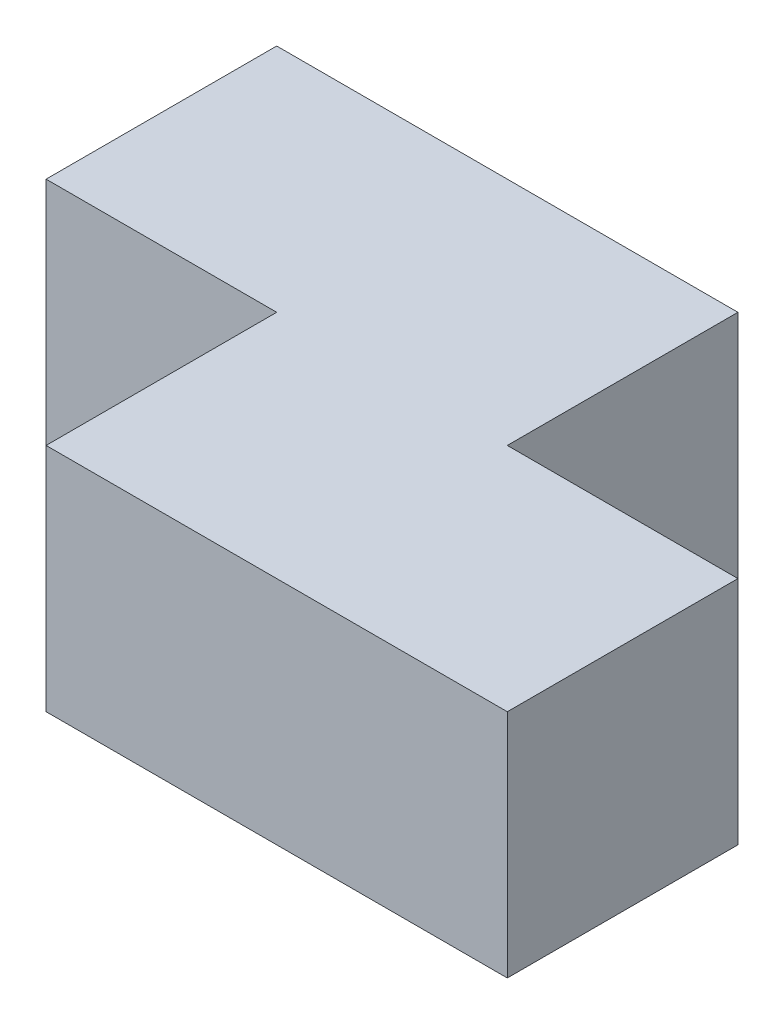
ISO-10303-21;
HEADER;
FILE_DESCRIPTION(('STEP AP214'),'2;1');
FILE_NAME('part.step','',(''),(''),'','','');
FILE_SCHEMA(('AUTOMOTIVE_DESIGN { 1 0 10303 214 1 1 1 1 }'));
ENDSEC;
DATA;
#1=APPLICATION_CONTEXT('core data for automotive mechanical design processes');
#2=APPLICATION_PROTOCOL_DEFINITION('international standard','automotive_design',2000,#1);
#3=PRODUCT_CONTEXT('',#1,'mechanical');
#4=PRODUCT('Part','Part','',(#3));
#5=PRODUCT_RELATED_PRODUCT_CATEGORY('part','',(#4));
#6=PRODUCT_DEFINITION_FORMATION('','',#4);
#7=PRODUCT_DEFINITION_CONTEXT('part definition',#1,'design');
#8=PRODUCT_DEFINITION('design','',#6,#7);
#9=PRODUCT_DEFINITION_SHAPE('','',#8);
#10=(LENGTH_UNIT() NAMED_UNIT(*) SI_UNIT(.MILLI.,.METRE.));
#11=(NAMED_UNIT(*) PLANE_ANGLE_UNIT() SI_UNIT($,.RADIAN.));
#12=(NAMED_UNIT(*) SI_UNIT($,.STERADIAN.) SOLID_ANGLE_UNIT());
#13=UNCERTAINTY_MEASURE_WITH_UNIT(LENGTH_MEASURE(1.E-05),#10,'distance_accuracy_value','');
#14=(GEOMETRIC_REPRESENTATION_CONTEXT(3) GLOBAL_UNCERTAINTY_ASSIGNED_CONTEXT((#13)) GLOBAL_UNIT_ASSIGNED_CONTEXT((#10,
#11,#12)) REPRESENTATION_CONTEXT('',''));
#15=CARTESIAN_POINT('',(0.,0.,0.));
#16=DIRECTION('',(0.,0.,1.));
#17=DIRECTION('',(1.,0.,0.));
#18=AXIS2_PLACEMENT_3D('',#15,#16,#17);
#19=CARTESIAN_POINT('',(38.1,25.4,25.4));
#20=DIRECTION('',(-1.,0.,0.));
#21=DIRECTION('',(0.,0.,1.));
#22=AXIS2_PLACEMENT_3D('',#19,#20,#21);
#23=PLANE('',#22);
#24=DIRECTION('',(0.,0.,-1.));
#25=VECTOR('',#24,1.);
#26=CARTESIAN_POINT('',(38.1,0.,25.4));
#27=LINE('',#26,#25);
#28=CARTESIAN_POINT('',(38.1,0.,25.4));
#29=VERTEX_POINT('',#28);
#30=CARTESIAN_POINT('',(38.1,0.,0.));
#31=VERTEX_POINT('',#30);
#32=EDGE_CURVE('E118',#29,#31,#27,.T.);
#33=ORIENTED_EDGE('',*,*,#32,.T.);
#34=DIRECTION('',(0.,1.,0.));
#35=VECTOR('',#34,1.);
#36=CARTESIAN_POINT('',(38.1,0.,0.));
#37=LINE('',#36,#35);
#38=CARTESIAN_POINT('',(38.1,25.4,0.));
#39=VERTEX_POINT('',#38);
#40=EDGE_CURVE('E156',#31,#39,#37,.T.);
#41=ORIENTED_EDGE('',*,*,#40,.T.);
#42=DIRECTION('',(0.,0.,-1.));
#43=VECTOR('',#42,1.);
#44=CARTESIAN_POINT('',(38.1,25.4,25.4));
#45=LINE('',#44,#43);
#46=CARTESIAN_POINT('',(38.1,25.4,25.4));
#47=VERTEX_POINT('',#46);
#48=EDGE_CURVE('E127',#47,#39,#45,.T.);
#49=ORIENTED_EDGE('',*,*,#48,.F.);
#50=DIRECTION('',(0.,-1.,0.));
#51=VECTOR('',#50,1.);
#52=CARTESIAN_POINT('',(38.1,25.4,25.4));
#53=LINE('',#52,#51);
#54=EDGE_CURVE('E40',#47,#29,#53,.T.);
#55=ORIENTED_EDGE('',*,*,#54,.T.);
#56=EDGE_LOOP('',(#33,#41,#49,#55));
#57=FACE_BOUND('',#56,.T.);
#58=ADVANCED_FACE('F33',(#57),#23,.F.);
#59=CARTESIAN_POINT('',(-38.1,25.4,-25.4));
#60=DIRECTION('',(0.,0.,1.));
#61=DIRECTION('',(1.,0.,0.));
#62=AXIS2_PLACEMENT_3D('',#59,#60,#61);
#63=PLANE('',#62);
#64=DIRECTION('',(-1.,0.,0.));
#65=VECTOR('',#64,1.);
#66=CARTESIAN_POINT('',(-38.1,25.4,-25.4));
#67=LINE('',#66,#65);
#68=CARTESIAN_POINT('',(12.7,25.4,-25.4));
#69=VERTEX_POINT('',#68);
#70=CARTESIAN_POINT('',(-38.1,25.4,-25.4));
#71=VERTEX_POINT('',#70);
#72=EDGE_CURVE('E112',#69,#71,#67,.T.);
#73=ORIENTED_EDGE('',*,*,#72,.F.);
#74=DIRECTION('',(0.,1.,0.));
#75=VECTOR('',#74,1.);
#76=CARTESIAN_POINT('',(12.7,0.,-25.4));
#77=LINE('',#76,#75);
#78=CARTESIAN_POINT('',(12.7,0.,-25.4));
#79=VERTEX_POINT('',#78);
#80=EDGE_CURVE('E100',#79,#69,#77,.T.);
#81=ORIENTED_EDGE('',*,*,#80,.F.);
#82=DIRECTION('',(-1.,0.,0.));
#83=VECTOR('',#82,1.);
#84=CARTESIAN_POINT('',(-38.1,0.,-25.4));
#85=LINE('',#84,#83);
#86=CARTESIAN_POINT('',(-38.1,0.,-25.4));
#87=VERTEX_POINT('',#86);
#88=EDGE_CURVE('E111',#79,#87,#85,.T.);
#89=ORIENTED_EDGE('',*,*,#88,.T.);
#90=DIRECTION('',(0.,-1.,0.));
#91=VECTOR('',#90,1.);
#92=CARTESIAN_POINT('',(-38.1,25.4,-25.4));
#93=LINE('',#92,#91);
#94=EDGE_CURVE('E11',#71,#87,#93,.T.);
#95=ORIENTED_EDGE('',*,*,#94,.F.);
#96=EDGE_LOOP('',(#73,#81,#89,#95));
#97=FACE_BOUND('',#96,.T.);
#98=ADVANCED_FACE('F109',(#97),#63,.F.);
#99=CARTESIAN_POINT('',(-38.1,25.4,25.4));
#100=DIRECTION('',(1.,0.,0.));
#101=DIRECTION('',(0.,0.,-1.));
#102=AXIS2_PLACEMENT_3D('',#99,#100,#101);
#103=PLANE('',#102);
#104=DIRECTION('',(0.,0.,1.));
#105=VECTOR('',#104,1.);
#106=CARTESIAN_POINT('',(-38.1,0.,25.4));
#107=LINE('',#106,#105);
#108=CARTESIAN_POINT('',(-38.1,0.,0.));
#109=VERTEX_POINT('',#108);
#110=EDGE_CURVE('E117',#87,#109,#107,.T.);
#111=ORIENTED_EDGE('',*,*,#110,.T.);
#112=DIRECTION('',(0.,1.,0.));
#113=VECTOR('',#112,1.);
#114=CARTESIAN_POINT('',(-38.1,0.,0.));
#115=LINE('',#114,#113);
#116=CARTESIAN_POINT('',(-38.1,25.4,0.));
#117=VERTEX_POINT('',#116);
#118=EDGE_CURVE('E123',#109,#117,#115,.T.);
#119=ORIENTED_EDGE('',*,*,#118,.T.);
#120=DIRECTION('',(0.,0.,1.));
#121=VECTOR('',#120,1.);
#122=CARTESIAN_POINT('',(-38.1,25.4,25.4));
#123=LINE('',#122,#121);
#124=EDGE_CURVE('E134',#71,#117,#123,.T.);
#125=ORIENTED_EDGE('',*,*,#124,.F.);
#126=ORIENTED_EDGE('',*,*,#94,.T.);
#127=EDGE_LOOP('',(#111,#119,#125,#126));
#128=FACE_BOUND('',#127,.T.);
#129=ADVANCED_FACE('F185',(#128),#103,.F.);
#130=CARTESIAN_POINT('',(-38.1,25.4,25.4));
#131=DIRECTION('',(0.,0.,-1.));
#132=DIRECTION('',(-1.,0.,0.));
#133=AXIS2_PLACEMENT_3D('',#130,#131,#132);
#134=PLANE('',#133);
#135=DIRECTION('',(1.,0.,0.));
#136=VECTOR('',#135,1.);
#137=CARTESIAN_POINT('',(-38.1,25.4,25.4));
#138=LINE('',#137,#136);
#139=CARTESIAN_POINT('',(-12.7,25.4,25.4));
#140=VERTEX_POINT('',#139);
#141=EDGE_CURVE('E129',#140,#47,#138,.T.);
#142=ORIENTED_EDGE('',*,*,#141,.F.);
#143=DIRECTION('',(0.,1.,0.));
#144=VECTOR('',#143,1.);
#145=CARTESIAN_POINT('',(-12.7,0.,25.4));
#146=LINE('',#145,#144);
#147=CARTESIAN_POINT('',(-12.7,0.,25.4));
#148=VERTEX_POINT('',#147);
#149=EDGE_CURVE('E144',#148,#140,#146,.T.);
#150=ORIENTED_EDGE('',*,*,#149,.F.);
#151=DIRECTION('',(1.,0.,0.));
#152=VECTOR('',#151,1.);
#153=CARTESIAN_POINT('',(-38.1,0.,25.4));
#154=LINE('',#153,#152);
#155=EDGE_CURVE('E120',#148,#29,#154,.T.);
#156=ORIENTED_EDGE('',*,*,#155,.T.);
#157=ORIENTED_EDGE('',*,*,#54,.F.);
#158=EDGE_LOOP('',(#142,#150,#156,#157));
#159=FACE_BOUND('',#158,.T.);
#160=ADVANCED_FACE('F189',(#159),#134,.F.);
#161=CARTESIAN_POINT('',(0.,25.4,0.));
#162=DIRECTION('',(0.,-1.,0.));
#163=DIRECTION('',(0.,0.,-1.));
#164=AXIS2_PLACEMENT_3D('',#161,#162,#163);
#165=PLANE('',#164);
#166=ORIENTED_EDGE('',*,*,#48,.T.);
#167=DIRECTION('',(1.,0.,0.));
#168=VECTOR('',#167,1.);
#169=CARTESIAN_POINT('',(38.1,25.4,0.));
#170=LINE('',#169,#168);
#171=CARTESIAN_POINT('',(12.7,25.4,0.));
#172=VERTEX_POINT('',#171);
#173=EDGE_CURVE('E105',#172,#39,#170,.T.);
#174=ORIENTED_EDGE('',*,*,#173,.F.);
#175=DIRECTION('',(0.,0.,1.));
#176=VECTOR('',#175,1.);
#177=CARTESIAN_POINT('',(12.7,25.4,-25.4));
#178=LINE('',#177,#176);
#179=EDGE_CURVE('E164',#69,#172,#178,.T.);
#180=ORIENTED_EDGE('',*,*,#179,.F.);
#181=ORIENTED_EDGE('',*,*,#72,.T.);
#182=ORIENTED_EDGE('',*,*,#124,.T.);
#183=DIRECTION('',(-1.,0.,0.));
#184=VECTOR('',#183,1.);
#185=CARTESIAN_POINT('',(-38.1,25.4,0.));
#186=LINE('',#185,#184);
#187=CARTESIAN_POINT('',(-12.7,25.4,0.));
#188=VERTEX_POINT('',#187);
#189=EDGE_CURVE('E150',#188,#117,#186,.T.);
#190=ORIENTED_EDGE('',*,*,#189,.F.);
#191=DIRECTION('',(0.,0.,-1.));
#192=VECTOR('',#191,1.);
#193=CARTESIAN_POINT('',(-12.7,25.4,25.4));
#194=LINE('',#193,#192);
#195=EDGE_CURVE('E153',#140,#188,#194,.T.);
#196=ORIENTED_EDGE('',*,*,#195,.F.);
#197=ORIENTED_EDGE('',*,*,#141,.T.);
#198=EDGE_LOOP('',(#166,#174,#180,#181,#182,#190,#196,#197));
#199=FACE_BOUND('',#198,.T.);
#200=ADVANCED_FACE('F168',(#199),#165,.F.);
#201=CARTESIAN_POINT('',(0.,0.,0.));
#202=DIRECTION('',(0.,-1.,0.));
#203=DIRECTION('',(0.,0.,-1.));
#204=AXIS2_PLACEMENT_3D('',#201,#202,#203);
#205=PLANE('',#204);
#206=DIRECTION('',(1.,0.,0.));
#207=VECTOR('',#206,1.);
#208=CARTESIAN_POINT('',(38.1,0.,0.));
#209=LINE('',#208,#207);
#210=CARTESIAN_POINT('',(12.7,0.,0.));
#211=VERTEX_POINT('',#210);
#212=EDGE_CURVE('E47',#211,#31,#209,.T.);
#213=ORIENTED_EDGE('',*,*,#212,.T.);
#214=ORIENTED_EDGE('',*,*,#32,.F.);
#215=ORIENTED_EDGE('',*,*,#155,.F.);
#216=DIRECTION('',(0.,0.,-1.));
#217=VECTOR('',#216,1.);
#218=CARTESIAN_POINT('',(-12.7,0.,25.4));
#219=LINE('',#218,#217);
#220=CARTESIAN_POINT('',(-12.7,0.,0.));
#221=VERTEX_POINT('',#220);
#222=EDGE_CURVE('E152',#148,#221,#219,.T.);
#223=ORIENTED_EDGE('',*,*,#222,.T.);
#224=DIRECTION('',(-1.,0.,0.));
#225=VECTOR('',#224,1.);
#226=CARTESIAN_POINT('',(-38.1,0.,0.));
#227=LINE('',#226,#225);
#228=EDGE_CURVE('E55',#221,#109,#227,.T.);
#229=ORIENTED_EDGE('',*,*,#228,.T.);
#230=ORIENTED_EDGE('',*,*,#110,.F.);
#231=ORIENTED_EDGE('',*,*,#88,.F.);
#232=DIRECTION('',(0.,0.,1.));
#233=VECTOR('',#232,1.);
#234=CARTESIAN_POINT('',(12.7,0.,-25.4));
#235=LINE('',#234,#233);
#236=EDGE_CURVE('E96',#79,#211,#235,.T.);
#237=ORIENTED_EDGE('',*,*,#236,.T.);
#238=EDGE_LOOP('',(#213,#214,#215,#223,#229,#230,#231,#237));
#239=FACE_BOUND('',#238,.T.);
#240=ADVANCED_FACE('F115',(#239),#205,.T.);
#241=CARTESIAN_POINT('',(-38.1,0.,0.));
#242=DIRECTION('',(0.,0.,-1.));
#243=DIRECTION('',(-1.,0.,0.));
#244=AXIS2_PLACEMENT_3D('',#241,#242,#243);
#245=PLANE('',#244);
#246=ORIENTED_EDGE('',*,*,#189,.T.);
#247=ORIENTED_EDGE('',*,*,#118,.F.);
#248=ORIENTED_EDGE('',*,*,#228,.F.);
#249=DIRECTION('',(0.,1.,0.));
#250=VECTOR('',#249,1.);
#251=CARTESIAN_POINT('',(-12.7,0.,0.));
#252=LINE('',#251,#250);
#253=EDGE_CURVE('E146',#221,#188,#252,.T.);
#254=ORIENTED_EDGE('',*,*,#253,.T.);
#255=EDGE_LOOP('',(#246,#247,#248,#254));
#256=FACE_BOUND('',#255,.T.);
#257=ADVANCED_FACE('F178',(#256),#245,.F.);
#258=CARTESIAN_POINT('',(-12.7,0.,25.4));
#259=DIRECTION('',(1.,0.,0.));
#260=DIRECTION('',(0.,0.,-1.));
#261=AXIS2_PLACEMENT_3D('',#258,#259,#260);
#262=PLANE('',#261);
#263=ORIENTED_EDGE('',*,*,#195,.T.);
#264=ORIENTED_EDGE('',*,*,#253,.F.);
#265=ORIENTED_EDGE('',*,*,#222,.F.);
#266=ORIENTED_EDGE('',*,*,#149,.T.);
#267=EDGE_LOOP('',(#263,#264,#265,#266));
#268=FACE_BOUND('',#267,.T.);
#269=ADVANCED_FACE('F171',(#268),#262,.F.);
#270=CARTESIAN_POINT('',(38.1,0.,0.));
#271=DIRECTION('',(0.,0.,1.));
#272=DIRECTION('',(1.,0.,0.));
#273=AXIS2_PLACEMENT_3D('',#270,#271,#272);
#274=PLANE('',#273);
#275=ORIENTED_EDGE('',*,*,#173,.T.);
#276=ORIENTED_EDGE('',*,*,#40,.F.);
#277=ORIENTED_EDGE('',*,*,#212,.F.);
#278=DIRECTION('',(0.,1.,0.));
#279=VECTOR('',#278,1.);
#280=CARTESIAN_POINT('',(12.7,0.,0.));
#281=LINE('',#280,#279);
#282=EDGE_CURVE('E102',#211,#172,#281,.T.);
#283=ORIENTED_EDGE('',*,*,#282,.T.);
#284=EDGE_LOOP('',(#275,#276,#277,#283));
#285=FACE_BOUND('',#284,.T.);
#286=ADVANCED_FACE('F169',(#285),#274,.F.);
#287=CARTESIAN_POINT('',(12.7,0.,-25.4));
#288=DIRECTION('',(-1.,0.,0.));
#289=DIRECTION('',(0.,0.,1.));
#290=AXIS2_PLACEMENT_3D('',#287,#288,#289);
#291=PLANE('',#290);
#292=ORIENTED_EDGE('',*,*,#179,.T.);
#293=ORIENTED_EDGE('',*,*,#282,.F.);
#294=ORIENTED_EDGE('',*,*,#236,.F.);
#295=ORIENTED_EDGE('',*,*,#80,.T.);
#296=EDGE_LOOP('',(#292,#293,#294,#295));
#297=FACE_BOUND('',#296,.T.);
#298=ADVANCED_FACE('F99',(#297),#291,.F.);
#299=CLOSED_SHELL('',(#58,#98,#129,#160,#200,#240,#257,#269,#286,#298));
#300=MANIFOLD_SOLID_BREP('B2',#299);
#301=ADVANCED_BREP_SHAPE_REPRESENTATION('',(#18,#300),#14);
#302=SHAPE_DEFINITION_REPRESENTATION(#9,#301);
ENDSEC;
END-ISO-10303-21;
